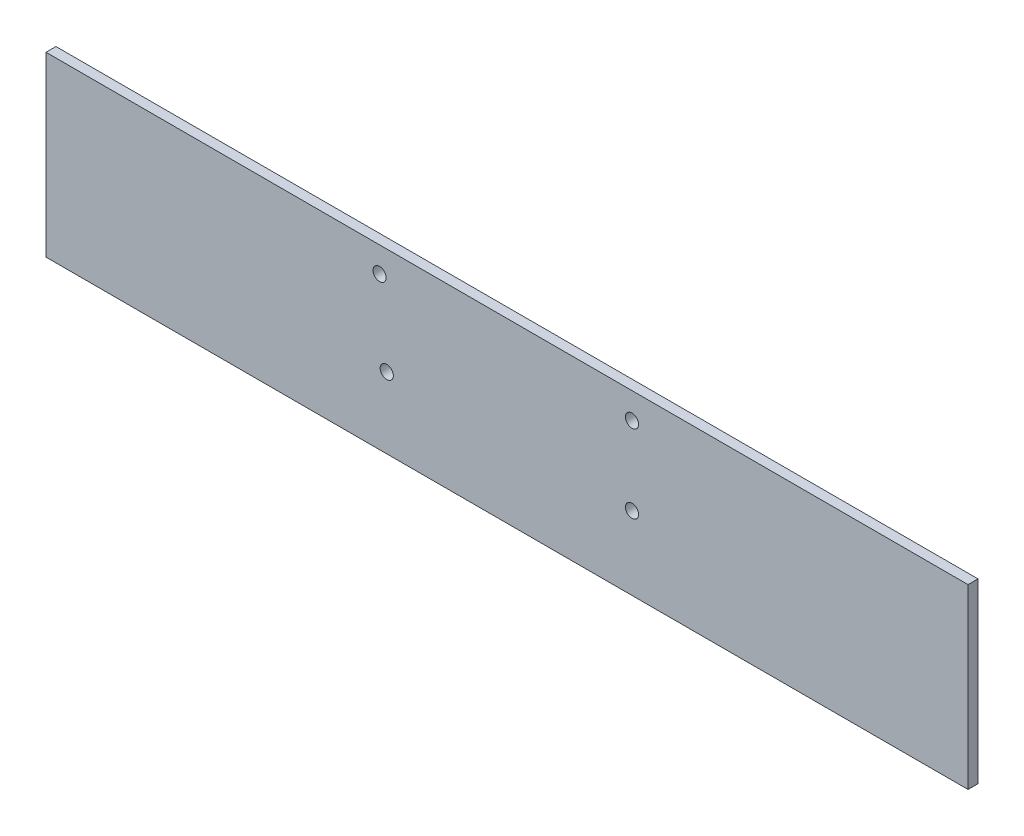
ISO-10303-21;
HEADER;
FILE_DESCRIPTION(('STEP AP214'),'2;1');
FILE_NAME('part.step','',(''),(''),'','','');
FILE_SCHEMA(('AUTOMOTIVE_DESIGN { 1 0 10303 214 1 1 1 1 }'));
ENDSEC;
DATA;
#1=APPLICATION_CONTEXT('core data for automotive mechanical design processes');
#2=APPLICATION_PROTOCOL_DEFINITION('international standard','automotive_design',2000,#1);
#3=PRODUCT_CONTEXT('',#1,'mechanical');
#4=PRODUCT('Part','Part','',(#3));
#5=PRODUCT_RELATED_PRODUCT_CATEGORY('part','',(#4));
#6=PRODUCT_DEFINITION_FORMATION('','',#4);
#7=PRODUCT_DEFINITION_CONTEXT('part definition',#1,'design');
#8=PRODUCT_DEFINITION('design','',#6,#7);
#9=PRODUCT_DEFINITION_SHAPE('','',#8);
#10=(LENGTH_UNIT() NAMED_UNIT(*) SI_UNIT(.MILLI.,.METRE.));
#11=(NAMED_UNIT(*) PLANE_ANGLE_UNIT() SI_UNIT($,.RADIAN.));
#12=(NAMED_UNIT(*) SI_UNIT($,.STERADIAN.) SOLID_ANGLE_UNIT());
#13=UNCERTAINTY_MEASURE_WITH_UNIT(LENGTH_MEASURE(1.E-05),#10,'distance_accuracy_value','');
#14=(GEOMETRIC_REPRESENTATION_CONTEXT(3) GLOBAL_UNCERTAINTY_ASSIGNED_CONTEXT((#13)) GLOBAL_UNIT_ASSIGNED_CONTEXT((#10,
#11,#12)) REPRESENTATION_CONTEXT('',''));
#15=CARTESIAN_POINT('',(0.,0.,0.));
#16=DIRECTION('',(0.,0.,1.));
#17=DIRECTION('',(1.,0.,0.));
#18=AXIS2_PLACEMENT_3D('',#15,#16,#17);
#19=CARTESIAN_POINT('',(10.4879414326653,139.509987818448,3.175));
#20=DIRECTION('',(1.,0.,0.));
#21=DIRECTION('',(0.,0.,-1.));
#22=AXIS2_PLACEMENT_3D('',#19,#20,#21);
#23=PLANE('',#22);
#24=DIRECTION('',(0.,-1.,0.));
#25=VECTOR('',#24,1.);
#26=CARTESIAN_POINT('',(10.4879414326653,139.509987818448,0.));
#27=LINE('',#26,#25);
#28=CARTESIAN_POINT('',(10.4879414326653,139.509987818448,0.));
#29=VERTEX_POINT('',#28);
#30=CARTESIAN_POINT('',(10.4879414326653,82.9111678184476,0.));
#31=VERTEX_POINT('',#30);
#32=EDGE_CURVE('E108',#29,#31,#27,.T.);
#33=ORIENTED_EDGE('',*,*,#32,.T.);
#34=DIRECTION('',(0.,0.,-1.));
#35=VECTOR('',#34,1.);
#36=CARTESIAN_POINT('',(10.4879414326653,82.9111678184476,3.175));
#37=LINE('',#36,#35);
#38=CARTESIAN_POINT('',(10.4879414326653,82.9111678184476,3.175));
#39=VERTEX_POINT('',#38);
#40=EDGE_CURVE('E11',#39,#31,#37,.T.);
#41=ORIENTED_EDGE('',*,*,#40,.F.);
#42=DIRECTION('',(0.,-1.,0.));
#43=VECTOR('',#42,1.);
#44=CARTESIAN_POINT('',(10.4879414326653,139.509987818448,3.175));
#45=LINE('',#44,#43);
#46=CARTESIAN_POINT('',(10.4879414326653,139.509987818448,3.175));
#47=VERTEX_POINT('',#46);
#48=EDGE_CURVE('E90',#47,#39,#45,.T.);
#49=ORIENTED_EDGE('',*,*,#48,.F.);
#50=DIRECTION('',(0.,0.,-1.));
#51=VECTOR('',#50,1.);
#52=CARTESIAN_POINT('',(10.4879414326653,139.509987818448,3.175));
#53=LINE('',#52,#51);
#54=EDGE_CURVE('E57',#47,#29,#53,.T.);
#55=ORIENTED_EDGE('',*,*,#54,.T.);
#56=EDGE_LOOP('',(#33,#41,#49,#55));
#57=FACE_BOUND('',#56,.T.);
#58=ADVANCED_FACE('F40',(#57),#23,.F.);
#59=CARTESIAN_POINT('',(10.4879414326653,82.9111678184476,3.175));
#60=DIRECTION('',(0.,1.,0.));
#61=DIRECTION('',(0.,0.,1.));
#62=AXIS2_PLACEMENT_3D('',#59,#60,#61);
#63=PLANE('',#62);
#64=DIRECTION('',(1.,0.,0.));
#65=VECTOR('',#64,1.);
#66=CARTESIAN_POINT('',(10.4879414326653,82.9111678184476,0.));
#67=LINE('',#66,#65);
#68=CARTESIAN_POINT('',(304.618107552665,82.9111678184476,0.));
#69=VERTEX_POINT('',#68);
#70=EDGE_CURVE('E96',#31,#69,#67,.T.);
#71=ORIENTED_EDGE('',*,*,#70,.T.);
#72=DIRECTION('',(0.,0.,-1.));
#73=VECTOR('',#72,1.);
#74=CARTESIAN_POINT('',(304.618107552665,82.9111678184476,3.175));
#75=LINE('',#74,#73);
#76=CARTESIAN_POINT('',(304.618107552665,82.9111678184476,3.175));
#77=VERTEX_POINT('',#76);
#78=EDGE_CURVE('E49',#77,#69,#75,.T.);
#79=ORIENTED_EDGE('',*,*,#78,.F.);
#80=DIRECTION('',(1.,0.,0.));
#81=VECTOR('',#80,1.);
#82=CARTESIAN_POINT('',(10.4879414326653,82.9111678184476,3.175));
#83=LINE('',#82,#81);
#84=EDGE_CURVE('E82',#39,#77,#83,.T.);
#85=ORIENTED_EDGE('',*,*,#84,.F.);
#86=ORIENTED_EDGE('',*,*,#40,.T.);
#87=EDGE_LOOP('',(#71,#79,#85,#86));
#88=FACE_BOUND('',#87,.T.);
#89=ADVANCED_FACE('F95',(#88),#63,.F.);
#90=CARTESIAN_POINT('',(304.618107552665,139.509987818448,3.175));
#91=DIRECTION('',(1.,0.,0.));
#92=DIRECTION('',(0.,0.,-1.));
#93=AXIS2_PLACEMENT_3D('',#90,#91,#92);
#94=PLANE('',#93);
#95=DIRECTION('',(0.,-1.,0.));
#96=VECTOR('',#95,1.);
#97=CARTESIAN_POINT('',(304.618107552665,139.509987818448,0.));
#98=LINE('',#97,#96);
#99=CARTESIAN_POINT('',(304.618107552665,139.509987818448,0.));
#100=VERTEX_POINT('',#99);
#101=EDGE_CURVE('E114',#100,#69,#98,.T.);
#102=ORIENTED_EDGE('',*,*,#101,.F.);
#103=DIRECTION('',(0.,0.,-1.));
#104=VECTOR('',#103,1.);
#105=CARTESIAN_POINT('',(304.618107552665,139.509987818448,3.175));
#106=LINE('',#105,#104);
#107=CARTESIAN_POINT('',(304.618107552665,139.509987818448,3.175));
#108=VERTEX_POINT('',#107);
#109=EDGE_CURVE('E71',#108,#100,#106,.T.);
#110=ORIENTED_EDGE('',*,*,#109,.F.);
#111=DIRECTION('',(0.,-1.,0.));
#112=VECTOR('',#111,1.);
#113=CARTESIAN_POINT('',(304.618107552665,139.509987818448,3.175));
#114=LINE('',#113,#112);
#115=EDGE_CURVE('E89',#108,#77,#114,.T.);
#116=ORIENTED_EDGE('',*,*,#115,.T.);
#117=ORIENTED_EDGE('',*,*,#78,.T.);
#118=EDGE_LOOP('',(#102,#110,#116,#117));
#119=FACE_BOUND('',#118,.T.);
#120=ADVANCED_FACE('F100',(#119),#94,.T.);
#121=CARTESIAN_POINT('',(10.4879414326653,139.509987818448,3.175));
#122=DIRECTION('',(0.,1.,0.));
#123=DIRECTION('',(0.,0.,1.));
#124=AXIS2_PLACEMENT_3D('',#121,#122,#123);
#125=PLANE('',#124);
#126=DIRECTION('',(1.,0.,0.));
#127=VECTOR('',#126,1.);
#128=CARTESIAN_POINT('',(10.4879414326653,139.509987818448,0.));
#129=LINE('',#128,#127);
#130=EDGE_CURVE('E117',#29,#100,#129,.T.);
#131=ORIENTED_EDGE('',*,*,#130,.F.);
#132=ORIENTED_EDGE('',*,*,#54,.F.);
#133=DIRECTION('',(1.,0.,0.));
#134=VECTOR('',#133,1.);
#135=CARTESIAN_POINT('',(10.4879414326653,139.509987818448,3.175));
#136=LINE('',#135,#134);
#137=EDGE_CURVE('E102',#47,#108,#136,.T.);
#138=ORIENTED_EDGE('',*,*,#137,.T.);
#139=ORIENTED_EDGE('',*,*,#109,.T.);
#140=EDGE_LOOP('',(#131,#132,#138,#139));
#141=FACE_BOUND('',#140,.T.);
#142=ADVANCED_FACE('F172',(#141),#125,.T.);
#143=CARTESIAN_POINT('',(0.,0.,3.175));
#144=DIRECTION('',(0.,0.,1.));
#145=DIRECTION('',(1.,0.,0.));
#146=AXIS2_PLACEMENT_3D('',#143,#144,#145);
#147=PLANE('',#146);
#148=CARTESIAN_POINT('',(197.417547639685,106.3099887844,3.175));
#149=DIRECTION('',(0.,0.,1.));
#150=DIRECTION('',(1.,0.,0.));
#151=AXIS2_PLACEMENT_3D('',#148,#149,#150);
#152=CIRCLE('',#151,2.09999999999999);
#153=CARTESIAN_POINT('',(199.517547639685,106.3099887844,3.175));
#154=VERTEX_POINT('',#153);
#155=EDGE_CURVE('E135',#154,#154,#152,.T.);
#156=ORIENTED_EDGE('',*,*,#155,.F.);
#157=EDGE_LOOP('',(#156));
#158=FACE_BOUND('',#157,.T.);
#159=CARTESIAN_POINT('',(119.185547706302,105.54798194514,3.175));
#160=DIRECTION('',(0.,0.,1.));
#161=DIRECTION('',(1.,0.,0.));
#162=AXIS2_PLACEMENT_3D('',#159,#160,#161);
#163=CIRCLE('',#162,2.10000000000002);
#164=CARTESIAN_POINT('',(121.285547706302,105.54798194514,3.175));
#165=VERTEX_POINT('',#164);
#166=EDGE_CURVE('E143',#165,#165,#163,.T.);
#167=ORIENTED_EDGE('',*,*,#166,.F.);
#168=EDGE_LOOP('',(#167));
#169=FACE_BOUND('',#168,.T.);
#170=CARTESIAN_POINT('',(116.899545441352,131.455981745291,3.175));
#171=DIRECTION('',(0.,0.,1.));
#172=DIRECTION('',(1.,0.,0.));
#173=AXIS2_PLACEMENT_3D('',#170,#171,#172);
#174=CIRCLE('',#173,2.09999999999999);
#175=CARTESIAN_POINT('',(118.999545441352,131.455981745291,3.175));
#176=VERTEX_POINT('',#175);
#177=EDGE_CURVE('E151',#176,#176,#174,.T.);
#178=ORIENTED_EDGE('',*,*,#177,.F.);
#179=EDGE_LOOP('',(#178));
#180=FACE_BOUND('',#179,.T.);
#181=CARTESIAN_POINT('',(197.417545463557,131.201988784399,3.175));
#182=DIRECTION('',(0.,0.,1.));
#183=DIRECTION('',(1.,0.,0.));
#184=AXIS2_PLACEMENT_3D('',#181,#182,#183);
#185=CIRCLE('',#184,2.09999999999999);
#186=CARTESIAN_POINT('',(199.517545463557,131.201988784399,3.175));
#187=VERTEX_POINT('',#186);
#188=EDGE_CURVE('E127',#187,#187,#185,.T.);
#189=ORIENTED_EDGE('',*,*,#188,.F.);
#190=EDGE_LOOP('',(#189));
#191=FACE_BOUND('',#190,.T.);
#192=ORIENTED_EDGE('',*,*,#48,.T.);
#193=ORIENTED_EDGE('',*,*,#84,.T.);
#194=ORIENTED_EDGE('',*,*,#115,.F.);
#195=ORIENTED_EDGE('',*,*,#137,.F.);
#196=EDGE_LOOP('',(#192,#193,#194,#195));
#197=FACE_BOUND('',#196,.T.);
#198=ADVANCED_FACE('F86',(#158,#169,#180,#191,#197),#147,.T.);
#199=CARTESIAN_POINT('',(0.,0.,0.));
#200=DIRECTION('',(0.,0.,1.));
#201=DIRECTION('',(1.,0.,0.));
#202=AXIS2_PLACEMENT_3D('',#199,#200,#201);
#203=PLANE('',#202);
#204=CARTESIAN_POINT('',(197.417547639685,106.3099887844,0.));
#205=DIRECTION('',(0.,0.,1.));
#206=DIRECTION('',(1.,0.,0.));
#207=AXIS2_PLACEMENT_3D('',#204,#205,#206);
#208=CIRCLE('',#207,2.09999999999999);
#209=CARTESIAN_POINT('',(199.517547639685,106.3099887844,0.));
#210=VERTEX_POINT('',#209);
#211=EDGE_CURVE('E139',#210,#210,#208,.T.);
#212=ORIENTED_EDGE('',*,*,#211,.T.);
#213=EDGE_LOOP('',(#212));
#214=FACE_BOUND('',#213,.T.);
#215=CARTESIAN_POINT('',(119.185547706302,105.54798194514,0.));
#216=DIRECTION('',(0.,0.,1.));
#217=DIRECTION('',(1.,0.,0.));
#218=AXIS2_PLACEMENT_3D('',#215,#216,#217);
#219=CIRCLE('',#218,2.10000000000002);
#220=CARTESIAN_POINT('',(121.285547706302,105.54798194514,0.));
#221=VERTEX_POINT('',#220);
#222=EDGE_CURVE('E147',#221,#221,#219,.T.);
#223=ORIENTED_EDGE('',*,*,#222,.T.);
#224=EDGE_LOOP('',(#223));
#225=FACE_BOUND('',#224,.T.);
#226=CARTESIAN_POINT('',(116.899545441352,131.455981745291,0.));
#227=DIRECTION('',(0.,0.,1.));
#228=DIRECTION('',(1.,0.,0.));
#229=AXIS2_PLACEMENT_3D('',#226,#227,#228);
#230=CIRCLE('',#229,2.09999999999999);
#231=CARTESIAN_POINT('',(118.999545441352,131.455981745291,0.));
#232=VERTEX_POINT('',#231);
#233=EDGE_CURVE('E131',#232,#232,#230,.T.);
#234=ORIENTED_EDGE('',*,*,#233,.T.);
#235=EDGE_LOOP('',(#234));
#236=FACE_BOUND('',#235,.T.);
#237=CARTESIAN_POINT('',(197.417545463557,131.201988784399,0.));
#238=DIRECTION('',(0.,0.,1.));
#239=DIRECTION('',(1.,0.,0.));
#240=AXIS2_PLACEMENT_3D('',#237,#238,#239);
#241=CIRCLE('',#240,2.09999999999999);
#242=CARTESIAN_POINT('',(199.517545463557,131.201988784399,0.));
#243=VERTEX_POINT('',#242);
#244=EDGE_CURVE('E111',#243,#243,#241,.T.);
#245=ORIENTED_EDGE('',*,*,#244,.T.);
#246=EDGE_LOOP('',(#245));
#247=FACE_BOUND('',#246,.T.);
#248=ORIENTED_EDGE('',*,*,#32,.F.);
#249=ORIENTED_EDGE('',*,*,#130,.T.);
#250=ORIENTED_EDGE('',*,*,#101,.T.);
#251=ORIENTED_EDGE('',*,*,#70,.F.);
#252=EDGE_LOOP('',(#248,#249,#250,#251));
#253=FACE_BOUND('',#252,.T.);
#254=ADVANCED_FACE('F159',(#214,#225,#236,#247,#253),#203,.F.);
#255=CARTESIAN_POINT('',(197.417545463557,131.201988784399,0.));
#256=DIRECTION('',(0.,0.,1.));
#257=DIRECTION('',(1.,0.,0.));
#258=AXIS2_PLACEMENT_3D('',#255,#256,#257);
#259=CYLINDRICAL_SURFACE('',#258,2.09999999999999);
#260=ORIENTED_EDGE('',*,*,#244,.F.);
#261=EDGE_LOOP('',(#260));
#262=FACE_BOUND('',#261,.T.);
#263=ORIENTED_EDGE('',*,*,#188,.T.);
#264=EDGE_LOOP('',(#263));
#265=FACE_BOUND('',#264,.T.);
#266=ADVANCED_FACE('F166',(#262,#265),#259,.F.);
#267=CARTESIAN_POINT('',(116.899545441352,131.455981745291,0.));
#268=DIRECTION('',(0.,0.,1.));
#269=DIRECTION('',(1.,0.,0.));
#270=AXIS2_PLACEMENT_3D('',#267,#268,#269);
#271=CYLINDRICAL_SURFACE('',#270,2.09999999999999);
#272=ORIENTED_EDGE('',*,*,#233,.F.);
#273=EDGE_LOOP('',(#272));
#274=FACE_BOUND('',#273,.T.);
#275=ORIENTED_EDGE('',*,*,#177,.T.);
#276=EDGE_LOOP('',(#275));
#277=FACE_BOUND('',#276,.T.);
#278=ADVANCED_FACE('F162',(#274,#277),#271,.F.);
#279=CARTESIAN_POINT('',(119.185547706302,105.54798194514,0.));
#280=DIRECTION('',(0.,0.,1.));
#281=DIRECTION('',(1.,0.,0.));
#282=AXIS2_PLACEMENT_3D('',#279,#280,#281);
#283=CYLINDRICAL_SURFACE('',#282,2.10000000000002);
#284=ORIENTED_EDGE('',*,*,#222,.F.);
#285=EDGE_LOOP('',(#284));
#286=FACE_BOUND('',#285,.T.);
#287=ORIENTED_EDGE('',*,*,#166,.T.);
#288=EDGE_LOOP('',(#287));
#289=FACE_BOUND('',#288,.T.);
#290=ADVANCED_FACE('F165',(#286,#289),#283,.F.);
#291=CARTESIAN_POINT('',(197.417547639685,106.3099887844,0.));
#292=DIRECTION('',(0.,0.,1.));
#293=DIRECTION('',(1.,0.,0.));
#294=AXIS2_PLACEMENT_3D('',#291,#292,#293);
#295=CYLINDRICAL_SURFACE('',#294,2.09999999999999);
#296=ORIENTED_EDGE('',*,*,#211,.F.);
#297=EDGE_LOOP('',(#296));
#298=FACE_BOUND('',#297,.T.);
#299=ORIENTED_EDGE('',*,*,#155,.T.);
#300=EDGE_LOOP('',(#299));
#301=FACE_BOUND('',#300,.T.);
#302=ADVANCED_FACE('F243',(#298,#301),#295,.F.);
#303=CLOSED_SHELL('',(#58,#89,#120,#142,#198,#254,#266,#278,#290,#302));
#304=MANIFOLD_SOLID_BREP('B2',#303);
#305=ADVANCED_BREP_SHAPE_REPRESENTATION('',(#18,#304),#14);
#306=SHAPE_DEFINITION_REPRESENTATION(#9,#305);
ENDSEC;
END-ISO-10303-21;
